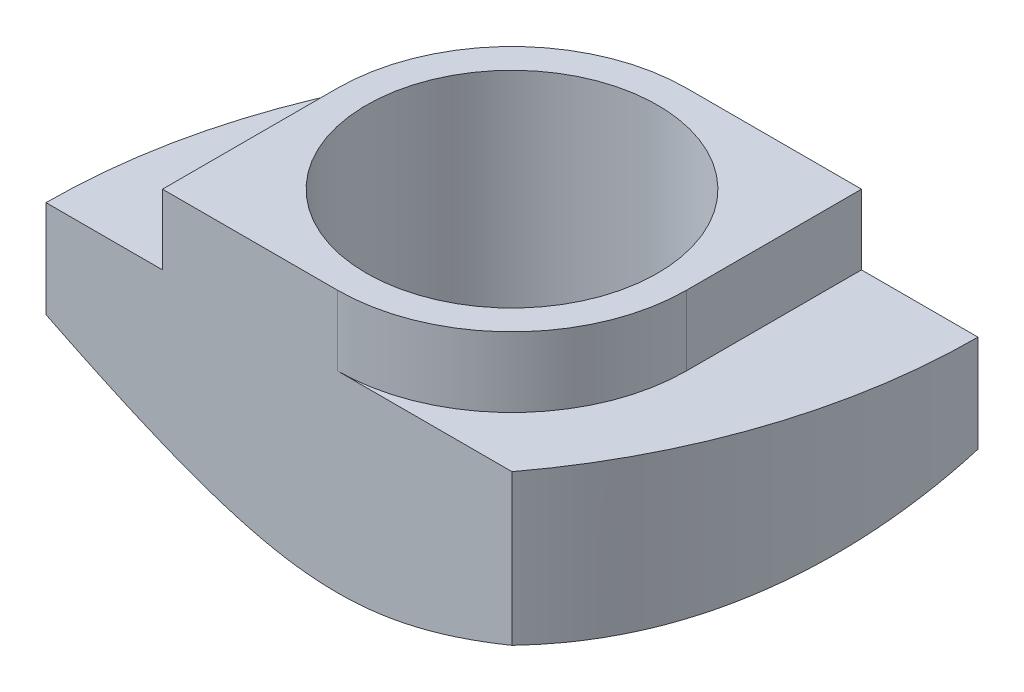
ISO-10303-21;
HEADER;
FILE_DESCRIPTION(('STEP AP214'),'2;1');
FILE_NAME('part.step','',(''),(''),'','','');
FILE_SCHEMA(('AUTOMOTIVE_DESIGN { 1 0 10303 214 1 1 1 1 }'));
ENDSEC;
DATA;
#1=APPLICATION_CONTEXT('core data for automotive mechanical design processes');
#2=APPLICATION_PROTOCOL_DEFINITION('international standard','automotive_design',2000,#1);
#3=PRODUCT_CONTEXT('',#1,'mechanical');
#4=PRODUCT('Part','Part','',(#3));
#5=PRODUCT_RELATED_PRODUCT_CATEGORY('part','',(#4));
#6=PRODUCT_DEFINITION_FORMATION('','',#4);
#7=PRODUCT_DEFINITION_CONTEXT('part definition',#1,'design');
#8=PRODUCT_DEFINITION('design','',#6,#7);
#9=PRODUCT_DEFINITION_SHAPE('','',#8);
#10=(LENGTH_UNIT() NAMED_UNIT(*) SI_UNIT(.MILLI.,.METRE.));
#11=(NAMED_UNIT(*) PLANE_ANGLE_UNIT() SI_UNIT($,.RADIAN.));
#12=(NAMED_UNIT(*) SI_UNIT($,.STERADIAN.) SOLID_ANGLE_UNIT());
#13=UNCERTAINTY_MEASURE_WITH_UNIT(LENGTH_MEASURE(1.E-05),#10,'distance_accuracy_value','');
#14=(GEOMETRIC_REPRESENTATION_CONTEXT(3) GLOBAL_UNCERTAINTY_ASSIGNED_CONTEXT((#13)) GLOBAL_UNIT_ASSIGNED_CONTEXT((#10,
#11,#12)) REPRESENTATION_CONTEXT('',''));
#15=CARTESIAN_POINT('',(0.,0.,0.));
#16=DIRECTION('',(0.,0.,1.));
#17=DIRECTION('',(1.,0.,0.));
#18=AXIS2_PLACEMENT_3D('',#15,#16,#17);
#19=CARTESIAN_POINT('',(0.,0.,0.));
#20=DIRECTION('',(0.,1.,0.));
#21=DIRECTION('',(0.,0.,1.));
#22=AXIS2_PLACEMENT_3D('',#19,#20,#21);
#23=PLANE('',#22);
#24=CARTESIAN_POINT('',(5.,0.,-3.));
#25=DIRECTION('',(0.,1.,0.));
#26=DIRECTION('',(0.,0.,1.));
#27=AXIS2_PLACEMENT_3D('',#24,#25,#26);
#28=CIRCLE('',#27,2.5);
#29=CARTESIAN_POINT('',(5.,0.,-0.499999999999999));
#30=VERTEX_POINT('',#29);
#31=EDGE_CURVE('E200',#30,#30,#28,.T.);
#32=ORIENTED_EDGE('',*,*,#31,.T.);
#33=EDGE_LOOP('',(#32));
#34=FACE_BOUND('',#33,.T.);
#35=CARTESIAN_POINT('',(5.,0.,-3.));
#36=DIRECTION('',(0.,1.,0.));
#37=DIRECTION('',(0.,0.,1.));
#38=AXIS2_PLACEMENT_3D('',#35,#36,#37);
#39=CIRCLE('',#38,3.);
#40=CARTESIAN_POINT('',(5.,0.,0.));
#41=VERTEX_POINT('',#40);
#42=CARTESIAN_POINT('',(5.,0.,-6.));
#43=VERTEX_POINT('',#42);
#44=EDGE_CURVE('E56',#41,#43,#39,.T.);
#45=ORIENTED_EDGE('',*,*,#44,.F.);
#46=EDGE_CURVE('E248',#43,#41,#39,.T.);
#47=ORIENTED_EDGE('',*,*,#46,.F.);
#48=EDGE_LOOP('',(#45,#47));
#49=FACE_BOUND('',#48,.T.);
#50=ADVANCED_FACE('F34',(#34,#49),#23,.F.);
#51=CARTESIAN_POINT('',(0.,3.3,0.));
#52=DIRECTION('',(0.,1.,0.));
#53=DIRECTION('',(0.,0.,1.));
#54=AXIS2_PLACEMENT_3D('',#51,#52,#53);
#55=PLANE('',#54);
#56=DIRECTION('',(1.,0.,0.));
#57=VECTOR('',#56,1.);
#58=CARTESIAN_POINT('',(0.,3.3,0.));
#59=LINE('',#58,#57);
#60=CARTESIAN_POINT('',(5.,3.3,0.));
#61=VERTEX_POINT('',#60);
#62=CARTESIAN_POINT('',(8.,3.3,0.));
#63=VERTEX_POINT('',#62);
#64=EDGE_CURVE('E203',#61,#63,#59,.T.);
#65=ORIENTED_EDGE('',*,*,#64,.T.);
#66=CARTESIAN_POINT('',(0.,3.3,-6.));
#67=DIRECTION('',(0.,1.,0.));
#68=DIRECTION('',(0.,0.,1.));
#69=AXIS2_PLACEMENT_3D('',#66,#67,#68);
#70=CIRCLE('',#69,10.);
#71=CARTESIAN_POINT('',(10.,3.3,-6.));
#72=VERTEX_POINT('',#71);
#73=EDGE_CURVE('E137',#63,#72,#70,.T.);
#74=ORIENTED_EDGE('',*,*,#73,.T.);
#75=DIRECTION('',(-1.,0.,0.));
#76=VECTOR('',#75,1.);
#77=CARTESIAN_POINT('',(10.,3.3,-6.));
#78=LINE('',#77,#76);
#79=CARTESIAN_POINT('',(8.,3.3,-6.));
#80=VERTEX_POINT('',#79);
#81=EDGE_CURVE('E207',#72,#80,#78,.T.);
#82=ORIENTED_EDGE('',*,*,#81,.T.);
#83=DIRECTION('',(0.,0.,-1.));
#84=VECTOR('',#83,1.);
#85=CARTESIAN_POINT('',(8.,3.3,-3.));
#86=LINE('',#85,#84);
#87=CARTESIAN_POINT('',(8.,3.3,-3.));
#88=VERTEX_POINT('',#87);
#89=EDGE_CURVE('E162',#88,#80,#86,.T.);
#90=ORIENTED_EDGE('',*,*,#89,.F.);
#91=CARTESIAN_POINT('',(5.,3.3,-3.));
#92=DIRECTION('',(0.,1.,0.));
#93=DIRECTION('',(0.,0.,1.));
#94=AXIS2_PLACEMENT_3D('',#91,#92,#93);
#95=CIRCLE('',#94,3.);
#96=EDGE_CURVE('E178',#61,#88,#95,.T.);
#97=ORIENTED_EDGE('',*,*,#96,.F.);
#98=EDGE_LOOP('',(#65,#74,#82,#90,#97));
#99=FACE_BOUND('',#98,.T.);
#100=ADVANCED_FACE('F241',(#99),#55,.T.);
#101=CARTESIAN_POINT('',(5.,3.3,-6.));
#102=VERTEX_POINT('',#101);
#103=CARTESIAN_POINT('',(2.,3.3,-6.));
#104=VERTEX_POINT('',#103);
#105=EDGE_CURVE('E206',#102,#104,#78,.T.);
#106=ORIENTED_EDGE('',*,*,#105,.T.);
#107=CARTESIAN_POINT('',(10.,3.3,0.));
#108=DIRECTION('',(0.,1.,0.));
#109=DIRECTION('',(0.,0.,1.));
#110=AXIS2_PLACEMENT_3D('',#107,#108,#109);
#111=CIRCLE('',#110,10.);
#112=CARTESIAN_POINT('',(0.,3.3,0.));
#113=VERTEX_POINT('',#112);
#114=EDGE_CURVE('E138',#104,#113,#111,.T.);
#115=ORIENTED_EDGE('',*,*,#114,.T.);
#116=CARTESIAN_POINT('',(2.,3.3,0.));
#117=VERTEX_POINT('',#116);
#118=EDGE_CURVE('E204',#113,#117,#59,.T.);
#119=ORIENTED_EDGE('',*,*,#118,.T.);
#120=DIRECTION('',(0.,0.,1.));
#121=VECTOR('',#120,1.);
#122=CARTESIAN_POINT('',(2.,3.3,-3.));
#123=LINE('',#122,#121);
#124=CARTESIAN_POINT('',(2.,3.3,-3.));
#125=VERTEX_POINT('',#124);
#126=EDGE_CURVE('E175',#125,#117,#123,.T.);
#127=ORIENTED_EDGE('',*,*,#126,.F.);
#128=CARTESIAN_POINT('',(5.,3.3,-3.));
#129=DIRECTION('',(0.,1.,0.));
#130=DIRECTION('',(0.,0.,1.));
#131=AXIS2_PLACEMENT_3D('',#128,#129,#130);
#132=CIRCLE('',#131,3.);
#133=EDGE_CURVE('E157',#102,#125,#132,.T.);
#134=ORIENTED_EDGE('',*,*,#133,.F.);
#135=EDGE_LOOP('',(#106,#115,#119,#127,#134));
#136=FACE_BOUND('',#135,.T.);
#137=ADVANCED_FACE('F223',(#136),#55,.T.);
#138=CARTESIAN_POINT('',(0.,3.3,0.));
#139=DIRECTION('',(0.,0.,-1.));
#140=DIRECTION('',(-1.,0.,0.));
#141=AXIS2_PLACEMENT_3D('',#138,#139,#140);
#142=PLANE('',#141);
#143=DIRECTION('',(0.,-1.,0.));
#144=VECTOR('',#143,1.);
#145=CARTESIAN_POINT('',(0.,3.3,0.));
#146=LINE('',#145,#144);
#147=CARTESIAN_POINT('',(-3.24366470330662E-13,1.63445083855179,0.));
#148=VERTEX_POINT('',#147);
#149=EDGE_CURVE('E211',#113,#148,#146,.T.);
#150=ORIENTED_EDGE('',*,*,#149,.T.);
#151=CARTESIAN_POINT('',(-3.48354089563345,3.4631542293822,0.));
#152=CARTESIAN_POINT('',(-3.29597486330394,3.36106639550695,0.));
#153=CARTESIAN_POINT('',(-3.10825657186435,3.25925696777416,0.));
#154=CARTESIAN_POINT('',(-2.73243657797255,3.05634078984557,0.));
#155=CARTESIAN_POINT('',(-2.5443348690458,2.95523405164492,0.));
#156=CARTESIAN_POINT('',(-2.16754314576748,2.7538018324152,0.));
#157=CARTESIAN_POINT('',(-1.9788528108182,2.65347695052232,0.));
#158=CARTESIAN_POINT('',(-1.60091366280159,2.45388683760313,0.));
#159=CARTESIAN_POINT('',(-1.4116648534883,2.35462159947455,0.));
#160=CARTESIAN_POINT('',(-1.02524164555393,2.15365896361576,0.));
#161=CARTESIAN_POINT('',(-0.8280403256741,2.05201325422431,0.));
#162=CARTESIAN_POINT('',(-0.432695960924371,1.85057099146246,0.));
#163=CARTESIAN_POINT('',(-0.234552924780237,1.75077442100008,0.));
#164=CARTESIAN_POINT('',(0.162883359695517,1.55364245851288,0.));
#165=CARTESIAN_POINT('',(0.362176245959007,1.45630633868387,0.));
#166=CARTESIAN_POINT('',(0.762324718804677,1.26491023049441,0.));
#167=CARTESIAN_POINT('',(0.963180239466744,1.17085010484234,0.));
#168=CARTESIAN_POINT('',(1.38343026727147,0.979739072276507,0.));
#169=CARTESIAN_POINT('',(1.60299994538998,0.88307059772088,0.));
#170=CARTESIAN_POINT('',(2.04547375084331,0.69735902914914,0.));
#171=CARTESIAN_POINT('',(2.26837902508704,0.60831863218417,0.));
#172=CARTESIAN_POINT('',(2.71587411530371,0.442655016624038,0.));
#173=CARTESIAN_POINT('',(2.94041400517814,0.365899150641808,0.));
#174=CARTESIAN_POINT('',(3.39461601576851,0.229227597787427,0.));
#175=CARTESIAN_POINT('',(3.62427467627155,0.169300886276149,0.));
#176=CARTESIAN_POINT('',(4.02322465990986,0.0872805980964554,0.));
#177=CARTESIAN_POINT('',(4.19127727894278,0.0592837523497267,0.));
#178=CARTESIAN_POINT('',(4.5292151098055,0.0186074637942143,0.));
#179=CARTESIAN_POINT('',(4.6990994137994,0.0059207558536135,0.));
#180=CARTESIAN_POINT('',(5.03930108171887,-0.00262977241252047,0.));
#181=CARTESIAN_POINT('',(5.20961842215138,0.00150551330993417,0.));
#182=CARTESIAN_POINT('',(5.54905538169298,0.0260775606708888,0.));
#183=CARTESIAN_POINT('',(5.71817469995699,0.046518280036514,0.));
#184=CARTESIAN_POINT('',(6.21041720494079,0.126998763896669,0.));
#185=CARTESIAN_POINT('',(6.53037837617367,0.206187575434926,0.));
#186=CARTESIAN_POINT('',(7.00271458051536,0.349037152040476,0.));
#187=CARTESIAN_POINT('',(7.15912570423959,0.400762342441996,0.));
#188=CARTESIAN_POINT('',(7.46980507784735,0.510331282894903,0.));
#189=CARTESIAN_POINT('',(7.62407366659515,0.56817405262746,0.));
#190=CARTESIAN_POINT('',(7.93480614305929,0.690051999850857,0.));
#191=CARTESIAN_POINT('',(8.09122098247559,0.754210070214247,0.));
#192=CARTESIAN_POINT('',(8.40249027234101,0.886205459954125,0.));
#193=CARTESIAN_POINT('',(8.55734468914418,0.954042858464119,0.));
#194=CARTESIAN_POINT('',(8.86555799800479,1.09243578219465,0.));
#195=CARTESIAN_POINT('',(9.01891873253121,1.16298722478592,0.));
#196=CARTESIAN_POINT('',(9.32460842251836,1.30627573067987,0.));
#197=CARTESIAN_POINT('',(9.47693740317978,1.37901274036223,0.));
#198=CARTESIAN_POINT('',(9.79820053120999,1.53466195825838,0.));
#199=CARTESIAN_POINT('',(9.96703303795884,1.6177835459863,0.));
#200=CARTESIAN_POINT('',(10.3038632412007,1.78570321660941,0.));
#201=CARTESIAN_POINT('',(10.4718609260554,1.87050132279542,0.));
#202=CARTESIAN_POINT('',(10.9748649611314,2.12687945337828,0.));
#203=CARTESIAN_POINT('',(11.3088640254556,2.30043433806238,0.));
#204=CARTESIAN_POINT('',(11.9751121608167,2.6510056886816,0.));
#205=CARTESIAN_POINT('',(12.3073608873141,2.82802280602194,0.));
#206=CARTESIAN_POINT('',(12.9705826159141,3.18443539217417,0.));
#207=CARTESIAN_POINT('',(13.3015556063681,3.36383088263669,0.));
#208=CARTESIAN_POINT('',(13.9629546508884,3.72452873900892,0.));
#209=CARTESIAN_POINT('',(14.2933796343116,3.90583306508672,0.));
#210=CARTESIAN_POINT('',(14.9535351302881,4.26970632163444,0.));
#211=CARTESIAN_POINT('',(15.283265637775,4.45227526128877,0.));
#212=CARTESIAN_POINT('',(16.2715887158774,5.00135527393431,0.));
#213=CARTESIAN_POINT('',(16.9293934852191,5.36928373962133,0.));
#214=CARTESIAN_POINT('',(18.1529905725746,6.05649313509663,0.));
#215=CARTESIAN_POINT('',(18.7189493903871,6.37547824118398,0.));
#216=CARTESIAN_POINT('',(19.8502069114844,7.01466482957697,0.));
#217=CARTESIAN_POINT('',(20.4155055899518,7.33486635580312,0.));
#218=CARTESIAN_POINT('',(21.5446979395992,7.97561244762179,0.));
#219=CARTESIAN_POINT('',(22.1085924033624,8.2961556172868,0.));
#220=CARTESIAN_POINT('',(23.2359863545133,8.93788477394371,0.));
#221=CARTESIAN_POINT('',(23.7994858564567,9.25907073536042,0.));
#222=CARTESIAN_POINT('',(24.3628564341549,9.58048220217592,0.));
#223=B_SPLINE_CURVE_WITH_KNOTS('',3,(#151,#152,#153,#154,#155,#156,#157,#158,#159,#160,#161,
#162,#163,#164,#165,#166,#167,#168,#169,#170,#171,#172,#173,#174,#175,#176,#177,#178,#179,#180,
#181,#182,#183,#184,#185,#186,#187,#188,#189,#190,#191,#192,#193,#194,#195,#196,#197,#198,#199,
#200,#201,#202,#203,#204,#205,#206,#207,#208,#209,#210,#211,#212,#213,#214,#215,#216,#217,#218,
#219,#220,#221,#222),.UNSPECIFIED.,.F.,.F.,(4,2,2,2,2,2,2,2,2,2,2,2,2,2,2,2,2,2,2,2,2,2,2,2,2,2,
2,2,2,2,2,2,2,2,2,4),(0.,0.640646082744018,1.28130307481014,1.92241041026591,2.56351344599782,
3.22907485761254,3.89463011423436,4.55998613876232,5.22531424565795,5.94494255168289,
6.66482425475788,7.37631432111889,8.08733720317702,8.59786275771737,9.10814595678052,
9.61840203880022,10.1287820101375,11.11417846512,11.6083903995148,12.1025232579765,
12.6096583717152,13.1168043970399,13.6232152837851,14.1296137564642,14.6941568074279,
15.2587077067539,16.3878705232809,17.5172478708017,18.6466355062493,19.7773253488379,
20.9080234118331,23.1691436592293,25.11812872921,27.0671848517974,29.0130836914544,
30.9589065892674),.UNSPECIFIED.);
#224=EDGE_CURVE('E64',#148,#41,#223,.T.);
#225=ORIENTED_EDGE('',*,*,#224,.T.);
#226=CARTESIAN_POINT('',(8.,0.717438935214303,0.));
#227=VERTEX_POINT('',#226);
#228=EDGE_CURVE('E123',#41,#227,#223,.T.);
#229=ORIENTED_EDGE('',*,*,#228,.T.);
#230=DIRECTION('',(0.,-1.,0.));
#231=VECTOR('',#230,1.);
#232=CARTESIAN_POINT('',(8.,4.5,0.));
#233=LINE('',#232,#231);
#234=EDGE_CURVE('E132',#63,#227,#233,.T.);
#235=ORIENTED_EDGE('',*,*,#234,.F.);
#236=ORIENTED_EDGE('',*,*,#64,.F.);
#237=DIRECTION('',(0.,-1.,0.));
#238=VECTOR('',#237,1.);
#239=CARTESIAN_POINT('',(5.,4.5,0.));
#240=LINE('',#239,#238);
#241=CARTESIAN_POINT('',(5.,4.5,0.));
#242=VERTEX_POINT('',#241);
#243=EDGE_CURVE('E191',#242,#61,#240,.T.);
#244=ORIENTED_EDGE('',*,*,#243,.F.);
#245=DIRECTION('',(1.,0.,0.));
#246=VECTOR('',#245,1.);
#247=CARTESIAN_POINT('',(2.,4.5,0.));
#248=LINE('',#247,#246);
#249=CARTESIAN_POINT('',(2.,4.5,0.));
#250=VERTEX_POINT('',#249);
#251=EDGE_CURVE('E164',#250,#242,#248,.T.);
#252=ORIENTED_EDGE('',*,*,#251,.F.);
#253=DIRECTION('',(0.,-1.,0.));
#254=VECTOR('',#253,1.);
#255=CARTESIAN_POINT('',(2.,4.5,0.));
#256=LINE('',#255,#254);
#257=EDGE_CURVE('E194',#250,#117,#256,.T.);
#258=ORIENTED_EDGE('',*,*,#257,.T.);
#259=ORIENTED_EDGE('',*,*,#118,.F.);
#260=EDGE_LOOP('',(#150,#225,#229,#235,#236,#244,#252,#258,#259));
#261=FACE_BOUND('',#260,.T.);
#262=ADVANCED_FACE('F36',(#261),#142,.F.);
#263=CARTESIAN_POINT('',(10.,3.3,-6.));
#264=DIRECTION('',(0.,0.,1.));
#265=DIRECTION('',(1.,0.,0.));
#266=AXIS2_PLACEMENT_3D('',#263,#264,#265);
#267=PLANE('',#266);
#268=DIRECTION('',(0.,-1.,0.));
#269=VECTOR('',#268,1.);
#270=CARTESIAN_POINT('',(10.,3.3,-6.));
#271=LINE('',#270,#269);
#272=CARTESIAN_POINT('',(10.,1.63445083855182,-6.));
#273=VERTEX_POINT('',#272);
#274=EDGE_CURVE('E209',#72,#273,#271,.T.);
#275=ORIENTED_EDGE('',*,*,#274,.T.);
#276=CARTESIAN_POINT('',(-1.40561857244024,2.35173621330572,-6.));
#277=CARTESIAN_POINT('',(-1.25397265529403,2.27245864985572,-6.));
#278=CARTESIAN_POINT('',(-1.10212572356311,2.19356242290368,-6.));
#279=CARTESIAN_POINT('',(-0.797926931068504,2.03673334307666,-6.));
#280=CARTESIAN_POINT('',(-0.645575048225458,1.95880053305173,-6.));
#281=CARTESIAN_POINT('',(-0.340063594636513,1.80399798065544,-6.));
#282=CARTESIAN_POINT('',(-0.186903192800429,1.72712987575722,-6.));
#283=CARTESIAN_POINT('',(0.120139870122512,1.5748536350528,-6.));
#284=CARTESIAN_POINT('',(0.274022520350688,1.49944547738376,-6.));
#285=CARTESIAN_POINT('',(0.592838711857217,1.34555192697128,-6.));
#286=CARTESIAN_POINT('',(0.757832511329315,1.26719101392869,-6.));
#287=CARTESIAN_POINT('',(1.08907165626538,1.11316262504823,-6.));
#288=CARTESIAN_POINT('',(1.25531696919582,1.03749507948627,-6.));
#289=CARTESIAN_POINT('',(1.58933769479432,0.889722466393687,-6.));
#290=CARTESIAN_POINT('',(1.75711267404891,0.817616424765592,-6.));
#291=CARTESIAN_POINT('',(2.09462080784385,0.678160358202616,-6.));
#292=CARTESIAN_POINT('',(2.26435377105406,0.610809873068633,-6.));
#293=CARTESIAN_POINT('',(2.65136643366417,0.465597579758903,-6.));
#294=CARTESIAN_POINT('',(2.86937553750163,0.389650807203391,-6.));
#295=CARTESIAN_POINT('',(3.31028662321208,0.252948651700001,-6.));
#296=CARTESIAN_POINT('',(3.53318816745528,0.192191915975733,-6.));
#297=CARTESIAN_POINT('',(3.8683262655903,0.118211995849105,-6.));
#298=CARTESIAN_POINT('',(3.97870870986869,0.0965889364167803,-6.));
#299=CARTESIAN_POINT('',(4.20047951149643,0.0594086888068867,-6.));
#300=CARTESIAN_POINT('',(4.3118676106834,0.0438499867386372,-6.));
#301=CARTESIAN_POINT('',(4.53529798282001,0.0195133587374725,-6.));
#302=CARTESIAN_POINT('',(4.64733963015596,0.0107297679120183,-6.));
#303=CARTESIAN_POINT('',(4.87175647550942,0.000379332617219116,-6.));
#304=CARTESIAN_POINT('',(4.98413165472807,-0.00118791113831589,-6.));
#305=CARTESIAN_POINT('',(5.19764628481579,0.00277148857137352,-6.));
#306=CARTESIAN_POINT('',(5.29879903747366,0.00761265065544985,-6.));
#307=CARTESIAN_POINT('',(5.50065671154322,0.0230021983762474,-6.));
#308=CARTESIAN_POINT('',(5.60136163574607,0.033550548391816,-6.));
#309=CARTESIAN_POINT('',(5.90254528467495,0.073167122016007,-6.));
#310=CARTESIAN_POINT('',(6.10200746701726,0.110204697903757,-6.));
#311=CARTESIAN_POINT('',(6.40124363390341,0.178855981155596,-6.));
#312=CARTESIAN_POINT('',(6.50251046874456,0.204408461272853,-6.));
#313=CARTESIAN_POINT('',(6.70403705625503,0.259252095192599,-6.));
#314=CARTESIAN_POINT('',(6.80429680022836,0.288543281248023,-6.));
#315=CARTESIAN_POINT('',(7.00382356755234,0.350271982173112,-6.));
#316=CARTESIAN_POINT('',(7.10309067153083,0.38270923917316,-6.));
#317=CARTESIAN_POINT('',(7.30071381170325,0.450222770649685,-6.));
#318=CARTESIAN_POINT('',(7.39906989250976,0.4852989151249,-6.));
#319=CARTESIAN_POINT('',(7.70346064446434,0.597713921920858,-6.));
#320=CARTESIAN_POINT('',(7.908098653835,0.678832202819105,-6.));
#321=CARTESIAN_POINT('',(8.31459619955772,0.847788616846674,-6.));
#322=CARTESIAN_POINT('',(8.51645501337637,0.935628459922794,-6.));
#323=CARTESIAN_POINT('',(8.91819441914379,1.11612622597939,-6.));
#324=CARTESIAN_POINT('',(9.11807326752611,1.20878801174844,-6.));
#325=CARTESIAN_POINT('',(9.51617423020322,1.39753676798486,-6.));
#326=CARTESIAN_POINT('',(9.71439650707754,1.49362339733948,-6.));
#327=CARTESIAN_POINT('',(10.110141588826,1.68861605467659,-6.));
#328=CARTESIAN_POINT('',(10.3076608403631,1.7875292748598,-6.));
#329=CARTESIAN_POINT('',(10.701716268989,1.98730053062971,-6.));
#330=CARTESIAN_POINT('',(10.8982524252531,2.08815860719612,-6.));
#331=CARTESIAN_POINT('',(11.4865225989671,2.39286210531847,-6.));
#332=CARTESIAN_POINT('',(11.8771045746663,2.59892972330144,-6.));
#333=CARTESIAN_POINT('',(12.5969307202401,2.98309293399625,-6.));
#334=CARTESIAN_POINT('',(12.9264545816071,3.16066742258904,-6.));
#335=CARTESIAN_POINT('',(13.5845105255777,3.51774821657372,-6.));
#336=CARTESIAN_POINT('',(13.9130424704652,3.69725477572224,-6.));
#337=CARTESIAN_POINT('',(14.5676024632876,4.05669806126053,-6.));
#338=CARTESIAN_POINT('',(14.8936345470256,4.23662745022008,-6.));
#339=CARTESIAN_POINT('',(15.5450655538572,4.59751554836329,-6.));
#340=CARTESIAN_POINT('',(15.8704645636942,4.77847410090909,-6.));
#341=CARTESIAN_POINT('',(16.1956560234662,4.95980279203952,-6.));
#342=B_SPLINE_CURVE_WITH_KNOTS('',3,(#276,#277,#278,#279,#280,#281,#282,#283,#284,#285,#286,
#287,#288,#289,#290,#291,#292,#293,#294,#295,#296,#297,#298,#299,#300,#301,#302,#303,#304,#305,
#306,#307,#308,#309,#310,#311,#312,#313,#314,#315,#316,#317,#318,#319,#320,#321,#322,#323,#324,
#325,#326,#327,#328,#329,#330,#331,#332,#333,#334,#335,#336,#337,#338,#339,#340,#341),
.UNSPECIFIED.,.F.,.F.,(4,2,2,2,2,2,2,2,2,2,2,2,2,2,2,2,2,2,2,2,2,2,2,2,2,2,2,2,2,2,2,2,4),(0.,
0.51335605452534,1.02673486011919,1.54083096542749,2.05491936613242,2.60287016775475,
3.15080677406057,3.69859267626565,4.24632549592234,4.93857152391587,5.63075588070139,
5.96805812383488,6.30527610968576,6.64221182996128,6.9791289070929,7.28276335052054,
7.58639589884953,8.19391596741399,8.50719464829315,8.82047603193631,9.13373175894619,
9.44697206392391,10.1071585130063,10.7675134736496,11.4284058324142,12.0892325495556,
12.751924427711,13.4146302846148,14.7394176288646,15.862384843357,16.9855013922865,
18.1026581074075,19.2196491146606),.UNSPECIFIED.);
#343=EDGE_CURVE('E126',#273,#43,#342,.F.);
#344=ORIENTED_EDGE('',*,*,#343,.T.);
#345=CARTESIAN_POINT('',(2.,0.717438935214303,-6.));
#346=VERTEX_POINT('',#345);
#347=EDGE_CURVE('E139',#43,#346,#342,.F.);
#348=ORIENTED_EDGE('',*,*,#347,.T.);
#349=DIRECTION('',(0.,-1.,0.));
#350=VECTOR('',#349,1.);
#351=CARTESIAN_POINT('',(2.,4.5,-6.));
#352=LINE('',#351,#350);
#353=EDGE_CURVE('E49',#104,#346,#352,.T.);
#354=ORIENTED_EDGE('',*,*,#353,.F.);
#355=ORIENTED_EDGE('',*,*,#105,.F.);
#356=DIRECTION('',(0.,-1.,0.));
#357=VECTOR('',#356,1.);
#358=CARTESIAN_POINT('',(5.,4.5,-6.));
#359=LINE('',#358,#357);
#360=CARTESIAN_POINT('',(5.,4.5,-6.));
#361=VERTEX_POINT('',#360);
#362=EDGE_CURVE('E172',#361,#102,#359,.T.);
#363=ORIENTED_EDGE('',*,*,#362,.F.);
#364=DIRECTION('',(-1.,0.,0.));
#365=VECTOR('',#364,1.);
#366=CARTESIAN_POINT('',(8.,4.5,-6.));
#367=LINE('',#366,#365);
#368=CARTESIAN_POINT('',(8.,4.5,-6.));
#369=VERTEX_POINT('',#368);
#370=EDGE_CURVE('E170',#369,#361,#367,.T.);
#371=ORIENTED_EDGE('',*,*,#370,.F.);
#372=DIRECTION('',(0.,-1.,0.));
#373=VECTOR('',#372,1.);
#374=CARTESIAN_POINT('',(8.,4.5,-6.));
#375=LINE('',#374,#373);
#376=EDGE_CURVE('E185',#369,#80,#375,.T.);
#377=ORIENTED_EDGE('',*,*,#376,.T.);
#378=ORIENTED_EDGE('',*,*,#81,.F.);
#379=EDGE_LOOP('',(#275,#344,#348,#354,#355,#363,#371,#377,#378));
#380=FACE_BOUND('',#379,.T.);
#381=ADVANCED_FACE('F220',(#380),#267,.F.);
#382=CARTESIAN_POINT('',(5.,3.3,-3.));
#383=DIRECTION('',(0.,-1.,0.));
#384=DIRECTION('',(0.,0.,-1.));
#385=AXIS2_PLACEMENT_3D('',#382,#383,#384);
#386=CYLINDRICAL_SURFACE('',#385,2.5);
#387=ORIENTED_EDGE('',*,*,#31,.F.);
#388=EDGE_LOOP('',(#387));
#389=FACE_BOUND('',#388,.T.);
#390=CARTESIAN_POINT('',(5.,4.5,-3.));
#391=DIRECTION('',(0.,1.,0.));
#392=DIRECTION('',(0.,0.,1.));
#393=AXIS2_PLACEMENT_3D('',#390,#391,#392);
#394=CIRCLE('',#393,2.5);
#395=CARTESIAN_POINT('',(5.,4.5,-0.500000000000001));
#396=VERTEX_POINT('',#395);
#397=EDGE_CURVE('E154',#396,#396,#394,.T.);
#398=ORIENTED_EDGE('',*,*,#397,.T.);
#399=EDGE_LOOP('',(#398));
#400=FACE_BOUND('',#399,.T.);
#401=ADVANCED_FACE('F264',(#389,#400),#386,.F.);
#402=CARTESIAN_POINT('',(5.,4.5,-3.));
#403=DIRECTION('',(0.,1.,0.));
#404=DIRECTION('',(0.,0.,1.));
#405=AXIS2_PLACEMENT_3D('',#402,#403,#404);
#406=PLANE('',#405);
#407=CARTESIAN_POINT('',(5.,4.5,-3.));
#408=DIRECTION('',(0.,1.,0.));
#409=DIRECTION('',(0.,0.,1.));
#410=AXIS2_PLACEMENT_3D('',#407,#408,#409);
#411=CIRCLE('',#410,3.);
#412=CARTESIAN_POINT('',(2.,4.5,-3.));
#413=VERTEX_POINT('',#412);
#414=EDGE_CURVE('E158',#361,#413,#411,.T.);
#415=ORIENTED_EDGE('',*,*,#414,.T.);
#416=DIRECTION('',(0.,0.,1.));
#417=VECTOR('',#416,1.);
#418=CARTESIAN_POINT('',(2.,4.5,-3.));
#419=LINE('',#418,#417);
#420=EDGE_CURVE('E161',#413,#250,#419,.T.);
#421=ORIENTED_EDGE('',*,*,#420,.T.);
#422=ORIENTED_EDGE('',*,*,#251,.T.);
#423=CARTESIAN_POINT('',(5.,4.5,-3.));
#424=DIRECTION('',(0.,1.,0.));
#425=DIRECTION('',(0.,0.,1.));
#426=AXIS2_PLACEMENT_3D('',#423,#424,#425);
#427=CIRCLE('',#426,3.);
#428=CARTESIAN_POINT('',(8.,4.5,-3.));
#429=VERTEX_POINT('',#428);
#430=EDGE_CURVE('E166',#242,#429,#427,.T.);
#431=ORIENTED_EDGE('',*,*,#430,.T.);
#432=DIRECTION('',(0.,0.,-1.));
#433=VECTOR('',#432,1.);
#434=CARTESIAN_POINT('',(8.,4.5,-3.));
#435=LINE('',#434,#433);
#436=EDGE_CURVE('E168',#429,#369,#435,.T.);
#437=ORIENTED_EDGE('',*,*,#436,.T.);
#438=ORIENTED_EDGE('',*,*,#370,.T.);
#439=EDGE_LOOP('',(#415,#421,#422,#431,#437,#438));
#440=FACE_BOUND('',#439,.T.);
#441=ORIENTED_EDGE('',*,*,#397,.F.);
#442=EDGE_LOOP('',(#441));
#443=FACE_BOUND('',#442,.T.);
#444=ADVANCED_FACE('F233',(#440,#443),#406,.T.);
#445=CARTESIAN_POINT('',(5.,4.5,-3.));
#446=DIRECTION('',(0.,-1.,0.));
#447=DIRECTION('',(0.,0.,-1.));
#448=AXIS2_PLACEMENT_3D('',#445,#446,#447);
#449=CYLINDRICAL_SURFACE('',#448,3.);
#450=ORIENTED_EDGE('',*,*,#133,.T.);
#451=DIRECTION('',(0.,-1.,0.));
#452=VECTOR('',#451,1.);
#453=CARTESIAN_POINT('',(2.,4.5,-3.));
#454=LINE('',#453,#452);
#455=EDGE_CURVE('E197',#413,#125,#454,.T.);
#456=ORIENTED_EDGE('',*,*,#455,.F.);
#457=ORIENTED_EDGE('',*,*,#414,.F.);
#458=ORIENTED_EDGE('',*,*,#362,.T.);
#459=EDGE_LOOP('',(#450,#456,#457,#458));
#460=FACE_BOUND('',#459,.T.);
#461=ADVANCED_FACE('F227',(#460),#449,.T.);
#462=CARTESIAN_POINT('',(2.,4.5,-3.));
#463=DIRECTION('',(1.,0.,0.));
#464=DIRECTION('',(0.,0.,-1.));
#465=AXIS2_PLACEMENT_3D('',#462,#463,#464);
#466=PLANE('',#465);
#467=ORIENTED_EDGE('',*,*,#126,.T.);
#468=ORIENTED_EDGE('',*,*,#257,.F.);
#469=ORIENTED_EDGE('',*,*,#420,.F.);
#470=ORIENTED_EDGE('',*,*,#455,.T.);
#471=EDGE_LOOP('',(#467,#468,#469,#470));
#472=FACE_BOUND('',#471,.T.);
#473=ADVANCED_FACE('F275',(#472),#466,.F.);
#474=CARTESIAN_POINT('',(5.,4.5,-3.));
#475=DIRECTION('',(0.,-1.,0.));
#476=DIRECTION('',(0.,0.,-1.));
#477=AXIS2_PLACEMENT_3D('',#474,#475,#476);
#478=CYLINDRICAL_SURFACE('',#477,3.);
#479=ORIENTED_EDGE('',*,*,#96,.T.);
#480=DIRECTION('',(0.,-1.,0.));
#481=VECTOR('',#480,1.);
#482=CARTESIAN_POINT('',(8.,4.5,-3.));
#483=LINE('',#482,#481);
#484=EDGE_CURVE('E188',#429,#88,#483,.T.);
#485=ORIENTED_EDGE('',*,*,#484,.F.);
#486=ORIENTED_EDGE('',*,*,#430,.F.);
#487=ORIENTED_EDGE('',*,*,#243,.T.);
#488=EDGE_LOOP('',(#479,#485,#486,#487));
#489=FACE_BOUND('',#488,.T.);
#490=ADVANCED_FACE('F243',(#489),#478,.T.);
#491=CARTESIAN_POINT('',(8.,4.5,-3.));
#492=DIRECTION('',(-1.,0.,0.));
#493=DIRECTION('',(0.,0.,1.));
#494=AXIS2_PLACEMENT_3D('',#491,#492,#493);
#495=PLANE('',#494);
#496=ORIENTED_EDGE('',*,*,#89,.T.);
#497=ORIENTED_EDGE('',*,*,#376,.F.);
#498=ORIENTED_EDGE('',*,*,#436,.F.);
#499=ORIENTED_EDGE('',*,*,#484,.T.);
#500=EDGE_LOOP('',(#496,#497,#498,#499));
#501=FACE_BOUND('',#500,.T.);
#502=ADVANCED_FACE('F239',(#501),#495,.F.);
#503=CARTESIAN_POINT('',(10.,4.5,0.));
#504=DIRECTION('',(0.,-1.,0.));
#505=DIRECTION('',(0.,0.,-1.));
#506=AXIS2_PLACEMENT_3D('',#503,#504,#505);
#507=CYLINDRICAL_SURFACE('',#506,10.);
#508=CARTESIAN_POINT('',(2.00000027591422E-09,1.63451024787034,0.0002));
#509=CARTESIAN_POINT('',(-1.54407446185164E-06,1.59697252171592,-0.126178357483014));
#510=CARTESIAN_POINT('',(0.00239090220114062,1.5599454538674,-0.252696476967998));
#511=CARTESIAN_POINT('',(0.0120011201510398,1.48708805956588,-0.505903394574299));
#512=CARTESIAN_POINT('',(0.0192192419812539,1.45125782015408,-0.632592204415301));
#513=CARTESIAN_POINT('',(0.0481847559395159,1.34577120657096,-1.01294879651645));
#514=CARTESIAN_POINT('',(0.0772434389511224,1.27818622575618,-1.26668191825856));
#515=CARTESIAN_POINT('',(0.155363408725324,1.14994502629886,-1.77472751620831));
#516=CARTESIAN_POINT('',(0.204562032436676,1.08934011567006,-2.02903180467417));
#517=CARTESIAN_POINT('',(0.32315643685175,0.977868067166236,-2.53498528944506));
#518=CARTESIAN_POINT('',(0.392542906194199,0.92699645783303,-2.78663565450862));
#519=CARTESIAN_POINT('',(0.539983917631504,0.844008800002066,-3.24933303678542));
#520=CARTESIAN_POINT('',(0.615304390746804,0.810240244299939,-3.4609558875138));
#521=CARTESIAN_POINT('',(0.780613340957086,0.753186310074103,-3.87989712505261));
#522=CARTESIAN_POINT('',(0.870602775153467,0.729901615961033,-4.08721522999682));
#523=CARTESIAN_POINT('',(1.06442733737475,0.695179029057396,-4.4951424873994));
#524=CARTESIAN_POINT('',(1.16819753030575,0.683687656519535,-4.69577789797629));
#525=CARTESIAN_POINT('',(1.38921352807604,0.673074122789632,-5.08972623095807));
#526=CARTESIAN_POINT('',(1.50645200932498,0.673945270568729,-5.28304305763));
#527=CARTESIAN_POINT('',(1.68886381610776,0.684298385246571,-5.56207021484652));
#528=CARTESIAN_POINT('',(1.74919779700368,0.689038434618134,-5.65117924639833));
#529=CARTESIAN_POINT('',(1.87262858708468,0.701232769902513,-5.82729752581891));
#530=CARTESIAN_POINT('',(1.9357258972054,0.708687549747741,-5.91430638849809));
#531=CARTESIAN_POINT('',(2.00015000390632,0.71745935020167,-6.0002));
#532=B_SPLINE_CURVE_WITH_KNOTS('',3,(#508,#509,#510,#511,#512,#513,#514,#515,#516,#517,#518,
#519,#520,#521,#522,#523,#524,#525,#526,#527,#528,#529,#530,#531),.UNSPECIFIED.,.F.,.F.,(4,2,2,
2,2,2,2,2,2,2,2,4),(0.,0.395458918803352,0.790946535622182,1.58262396664039,2.37979234496399,
3.17659362183824,3.8573516910401,4.53815419525582,5.21585560435162,5.89319023171131,
6.21626640443446,6.53940138873766),.UNSPECIFIED.);
#533=EDGE_CURVE('E144',#148,#346,#532,.T.);
#534=ORIENTED_EDGE('',*,*,#533,.F.);
#535=ORIENTED_EDGE('',*,*,#149,.F.);
#536=ORIENTED_EDGE('',*,*,#114,.F.);
#537=ORIENTED_EDGE('',*,*,#353,.T.);
#538=EDGE_LOOP('',(#534,#535,#536,#537));
#539=FACE_BOUND('',#538,.T.);
#540=ADVANCED_FACE('F216',(#539),#507,.T.);
#541=CARTESIAN_POINT('',(0.,4.5,-6.));
#542=DIRECTION('',(0.,-1.,0.));
#543=DIRECTION('',(0.,0.,-1.));
#544=AXIS2_PLACEMENT_3D('',#541,#542,#543);
#545=CYLINDRICAL_SURFACE('',#544,10.);
#546=CARTESIAN_POINT('',(9.999999998,1.63451024787034,-6.0002));
#547=CARTESIAN_POINT('',(10.0000015440745,1.59697252171592,-5.87382164251699));
#548=CARTESIAN_POINT('',(9.99760909779886,1.5599454538674,-5.747303523032));
#549=CARTESIAN_POINT('',(9.98799887984896,1.48708805956588,-5.4940966054257));
#550=CARTESIAN_POINT('',(9.98078075801874,1.45125782015408,-5.3674077955847));
#551=CARTESIAN_POINT('',(9.95181524406049,1.34577120657096,-4.98705120348355));
#552=CARTESIAN_POINT('',(9.92275656104888,1.27818622575618,-4.73331808174144));
#553=CARTESIAN_POINT('',(9.84463659127468,1.14994502629886,-4.22527248379169));
#554=CARTESIAN_POINT('',(9.79543796756333,1.08934011567006,-3.97096819532583));
#555=CARTESIAN_POINT('',(9.67684356314825,0.977868067166235,-3.46501471055495));
#556=CARTESIAN_POINT('',(9.6074570938058,0.926996457833028,-3.21336434549138));
#557=CARTESIAN_POINT('',(9.46001608236849,0.844008800002065,-2.75066696321458));
#558=CARTESIAN_POINT('',(9.38469560925319,0.810240244299939,-2.5390441124862));
#559=CARTESIAN_POINT('',(9.21938665904291,0.753186310074104,-2.12010287494738));
#560=CARTESIAN_POINT('',(9.12939722484654,0.729901615961033,-1.91278477000317));
#561=CARTESIAN_POINT('',(8.93557266262525,0.695179029057396,-1.5048575126006));
#562=CARTESIAN_POINT('',(8.83180246969425,0.683687656519535,-1.30422210202371));
#563=CARTESIAN_POINT('',(8.61078647192396,0.673074122789632,-0.910273769041929));
#564=CARTESIAN_POINT('',(8.49354799067502,0.673945270568729,-0.716956942369994));
#565=CARTESIAN_POINT('',(8.31113618389224,0.684298385246571,-0.437929785153478));
#566=CARTESIAN_POINT('',(8.25080220299632,0.689038434618134,-0.348820753601674));
#567=CARTESIAN_POINT('',(8.12737141291532,0.701232769902513,-0.172702474181089));
#568=CARTESIAN_POINT('',(8.0642741027946,0.708687549747741,-0.0856936115019131));
#569=CARTESIAN_POINT('',(7.99984999609368,0.71745935020167,0.000200000000000131));
#570=B_SPLINE_CURVE_WITH_KNOTS('',3,(#546,#547,#548,#549,#550,#551,#552,#553,#554,#555,#556,
#557,#558,#559,#560,#561,#562,#563,#564,#565,#566,#567,#568,#569),.UNSPECIFIED.,.F.,.F.,(4,2,2,
2,2,2,2,2,2,2,2,4),(0.,0.395458918803351,0.790946535622182,1.58262396664039,2.37979234496399,
3.17659362183824,3.8573516910401,4.53815419525582,5.21585560435162,5.89319023171131,
6.21626640443446,6.53940138873766),.UNSPECIFIED.);
#571=EDGE_CURVE('E11',#273,#227,#570,.T.);
#572=ORIENTED_EDGE('',*,*,#571,.F.);
#573=ORIENTED_EDGE('',*,*,#274,.F.);
#574=ORIENTED_EDGE('',*,*,#73,.F.);
#575=ORIENTED_EDGE('',*,*,#234,.T.);
#576=EDGE_LOOP('',(#572,#573,#574,#575));
#577=FACE_BOUND('',#576,.T.);
#578=ADVANCED_FACE('F135',(#577),#545,.T.);
#579=CARTESIAN_POINT('',(5.,0.,-3.));
#580=DIRECTION('',(0.,1.,0.));
#581=DIRECTION('',(0.,0.,1.));
#582=AXIS2_PLACEMENT_3D('',#579,#580,#581);
#583=CONICAL_SURFACE('',#582,3.,1.0471975511966);
#584=ORIENTED_EDGE('',*,*,#44,.T.);
#585=ORIENTED_EDGE('',*,*,#343,.F.);
#586=ORIENTED_EDGE('',*,*,#571,.T.);
#587=ORIENTED_EDGE('',*,*,#228,.F.);
#588=EDGE_LOOP('',(#584,#585,#586,#587));
#589=FACE_BOUND('',#588,.T.);
#590=ADVANCED_FACE('F122',(#589),#583,.T.);
#591=ORIENTED_EDGE('',*,*,#46,.T.);
#592=ORIENTED_EDGE('',*,*,#224,.F.);
#593=ORIENTED_EDGE('',*,*,#533,.T.);
#594=ORIENTED_EDGE('',*,*,#347,.F.);
#595=EDGE_LOOP('',(#591,#592,#593,#594));
#596=FACE_BOUND('',#595,.T.);
#597=ADVANCED_FACE('F259',(#596),#583,.T.);
#598=CLOSED_SHELL('',(#50,#100,#137,#262,#381,#401,#444,#461,#473,#490,#502,#540,#578,#590,#597));
#599=MANIFOLD_SOLID_BREP('B2',#598);
#600=ADVANCED_BREP_SHAPE_REPRESENTATION('',(#18,#599),#14);
#601=SHAPE_DEFINITION_REPRESENTATION(#9,#600);
ENDSEC;
END-ISO-10303-21;
